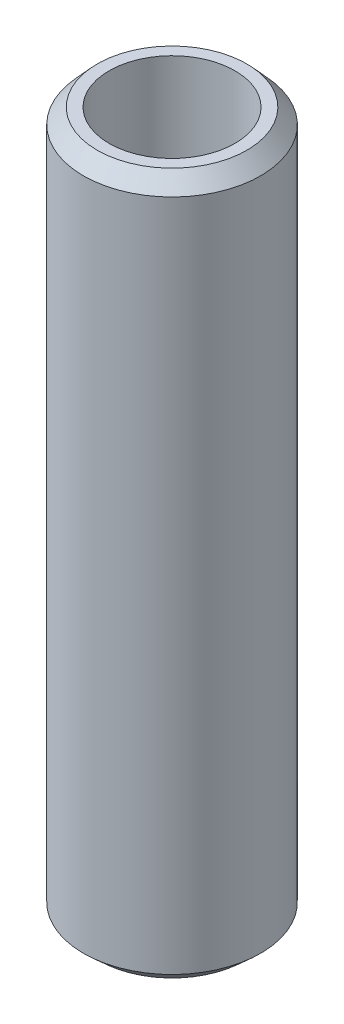
ISO-10303-21;
HEADER;
FILE_DESCRIPTION(('STEP AP214'),'2;1');
FILE_NAME('part.step','',(''),(''),'','','');
FILE_SCHEMA(('AUTOMOTIVE_DESIGN { 1 0 10303 214 1 1 1 1 }'));
ENDSEC;
DATA;
#1=APPLICATION_CONTEXT('core data for automotive mechanical design processes');
#2=APPLICATION_PROTOCOL_DEFINITION('international standard','automotive_design',2000,#1);
#3=PRODUCT_CONTEXT('',#1,'mechanical');
#4=PRODUCT('Part','Part','',(#3));
#5=PRODUCT_RELATED_PRODUCT_CATEGORY('part','',(#4));
#6=PRODUCT_DEFINITION_FORMATION('','',#4);
#7=PRODUCT_DEFINITION_CONTEXT('part definition',#1,'design');
#8=PRODUCT_DEFINITION('design','',#6,#7);
#9=PRODUCT_DEFINITION_SHAPE('','',#8);
#10=(LENGTH_UNIT() NAMED_UNIT(*) SI_UNIT(.MILLI.,.METRE.));
#11=(NAMED_UNIT(*) PLANE_ANGLE_UNIT() SI_UNIT($,.RADIAN.));
#12=(NAMED_UNIT(*) SI_UNIT($,.STERADIAN.) SOLID_ANGLE_UNIT());
#13=UNCERTAINTY_MEASURE_WITH_UNIT(LENGTH_MEASURE(1.E-05),#10,'distance_accuracy_value','');
#14=(GEOMETRIC_REPRESENTATION_CONTEXT(3) GLOBAL_UNCERTAINTY_ASSIGNED_CONTEXT((#13)) GLOBAL_UNIT_ASSIGNED_CONTEXT((#10,
#11,#12)) REPRESENTATION_CONTEXT('',''));
#15=CARTESIAN_POINT('',(0.,0.,0.));
#16=DIRECTION('',(0.,0.,1.));
#17=DIRECTION('',(1.,0.,0.));
#18=AXIS2_PLACEMENT_3D('',#15,#16,#17);
#19=CARTESIAN_POINT('',(0.,198.114677756103,0.));
#20=DIRECTION('',(0.,-1.,0.));
#21=DIRECTION('',(0.,0.,-1.));
#22=AXIS2_PLACEMENT_3D('',#19,#20,#21);
#23=CYLINDRICAL_SURFACE('',#22,25.);
#24=CARTESIAN_POINT('',(0.,193.822095082778,0.));
#25=DIRECTION('',(0.,1.,0.));
#26=DIRECTION('',(0.,0.,1.));
#27=AXIS2_PLACEMENT_3D('',#24,#25,#26);
#28=CIRCLE('',#27,25.);
#29=CARTESIAN_POINT('',(0.,193.822095082778,25.));
#30=VERTEX_POINT('',#29);
#31=EDGE_CURVE('E50',#30,#30,#28,.F.);
#32=ORIENTED_EDGE('',*,*,#31,.T.);
#33=EDGE_LOOP('',(#32));
#34=FACE_BOUND('',#33,.T.);
#35=CARTESIAN_POINT('',(0.,3.89384290129469,0.));
#36=DIRECTION('',(0.,1.,0.));
#37=DIRECTION('',(0.,0.,1.));
#38=AXIS2_PLACEMENT_3D('',#35,#36,#37);
#39=CIRCLE('',#38,25.);
#40=CARTESIAN_POINT('',(0.,3.89384290129469,25.));
#41=VERTEX_POINT('',#40);
#42=EDGE_CURVE('E51',#41,#41,#39,.T.);
#43=ORIENTED_EDGE('',*,*,#42,.T.);
#44=EDGE_LOOP('',(#43));
#45=FACE_BOUND('',#44,.T.);
#46=ADVANCED_FACE('F39',(#34,#45),#23,.T.);
#47=CARTESIAN_POINT('',(0.,198.114677756103,0.));
#48=DIRECTION('',(0.,1.,0.));
#49=DIRECTION('',(0.,0.,1.));
#50=AXIS2_PLACEMENT_3D('',#47,#48,#49);
#51=PLANE('',#50);
#52=CARTESIAN_POINT('',(0.,198.114677756103,0.));
#53=DIRECTION('',(0.,1.,0.));
#54=DIRECTION('',(0.,0.,1.));
#55=AXIS2_PLACEMENT_3D('',#52,#53,#54);
#56=CIRCLE('',#55,21.1061570987053);
#57=CARTESIAN_POINT('',(0.,198.114677756103,21.1061570987053));
#58=VERTEX_POINT('',#57);
#59=EDGE_CURVE('E54',#58,#58,#56,.T.);
#60=ORIENTED_EDGE('',*,*,#59,.T.);
#61=EDGE_LOOP('',(#60));
#62=FACE_BOUND('',#61,.T.);
#63=CARTESIAN_POINT('',(0.,198.114677756103,0.));
#64=DIRECTION('',(0.,1.,0.));
#65=DIRECTION('',(0.,0.,1.));
#66=AXIS2_PLACEMENT_3D('',#63,#64,#65);
#67=CIRCLE('',#66,17.7572472351798);
#68=CARTESIAN_POINT('',(0.,198.114677756103,17.7572472351798));
#69=VERTEX_POINT('',#68);
#70=EDGE_CURVE('E58',#69,#69,#67,.T.);
#71=ORIENTED_EDGE('',*,*,#70,.F.);
#72=EDGE_LOOP('',(#71));
#73=FACE_BOUND('',#72,.T.);
#74=ADVANCED_FACE('F69',(#62,#73),#51,.T.);
#75=CARTESIAN_POINT('',(0.,0.,0.));
#76=DIRECTION('',(0.,1.,0.));
#77=DIRECTION('',(0.,0.,1.));
#78=AXIS2_PLACEMENT_3D('',#75,#76,#77);
#79=PLANE('',#78);
#80=CARTESIAN_POINT('',(0.,0.,0.));
#81=DIRECTION('',(0.,1.,0.));
#82=DIRECTION('',(0.,0.,1.));
#83=AXIS2_PLACEMENT_3D('',#80,#81,#82);
#84=CIRCLE('',#83,20.7074173266759);
#85=CARTESIAN_POINT('',(0.,0.,20.7074173266759));
#86=VERTEX_POINT('',#85);
#87=EDGE_CURVE('E10',#86,#86,#84,.F.);
#88=ORIENTED_EDGE('',*,*,#87,.T.);
#89=EDGE_LOOP('',(#88));
#90=FACE_BOUND('',#89,.T.);
#91=CARTESIAN_POINT('',(0.,0.,0.));
#92=DIRECTION('',(0.,1.,0.));
#93=DIRECTION('',(0.,0.,1.));
#94=AXIS2_PLACEMENT_3D('',#91,#92,#93);
#95=CIRCLE('',#94,17.7572472351798);
#96=CARTESIAN_POINT('',(0.,0.,17.7572472351798));
#97=VERTEX_POINT('',#96);
#98=EDGE_CURVE('E63',#97,#97,#95,.T.);
#99=ORIENTED_EDGE('',*,*,#98,.T.);
#100=EDGE_LOOP('',(#99));
#101=FACE_BOUND('',#100,.T.);
#102=ADVANCED_FACE('F75',(#90,#101),#79,.F.);
#103=CARTESIAN_POINT('',(0.,198.114677756103,0.));
#104=DIRECTION('',(0.,-1.,0.));
#105=DIRECTION('',(0.,0.,-1.));
#106=AXIS2_PLACEMENT_3D('',#103,#104,#105);
#107=CYLINDRICAL_SURFACE('',#106,17.7572472351798);
#108=ORIENTED_EDGE('',*,*,#70,.T.);
#109=EDGE_LOOP('',(#108));
#110=FACE_BOUND('',#109,.T.);
#111=ORIENTED_EDGE('',*,*,#98,.F.);
#112=EDGE_LOOP('',(#111));
#113=FACE_BOUND('',#112,.T.);
#114=ADVANCED_FACE('F70',(#110,#113),#107,.F.);
#115=CARTESIAN_POINT('',(0.,198.114677756103,0.));
#116=DIRECTION('',(0.,-1.,0.));
#117=DIRECTION('',(0.,0.,-1.));
#118=AXIS2_PLACEMENT_3D('',#115,#116,#117);
#119=CONICAL_SURFACE('',#118,21.1061570987053,0.736729194112089);
#120=ORIENTED_EDGE('',*,*,#31,.F.);
#121=EDGE_LOOP('',(#120));
#122=FACE_BOUND('',#121,.T.);
#123=ORIENTED_EDGE('',*,*,#59,.F.);
#124=EDGE_LOOP('',(#123));
#125=FACE_BOUND('',#124,.T.);
#126=ADVANCED_FACE('F81',(#122,#125),#119,.T.);
#127=CARTESIAN_POINT('',(0.,3.89384290129469,0.));
#128=DIRECTION('',(0.,1.,0.));
#129=DIRECTION('',(0.,0.,1.));
#130=AXIS2_PLACEMENT_3D('',#127,#128,#129);
#131=CONICAL_SURFACE('',#130,25.,0.834067132682809);
#132=CARTESIAN_POINT('',(0.,0.,20.7074173266759));
#133=CARTESIAN_POINT('',(0.,0.0405608635551529,20.752131729523));
#134=CARTESIAN_POINT('',(0.,0.0811217271103057,20.7968461323702));
#135=CARTESIAN_POINT('',(0.,0.162243454220611,20.8862749380644));
#136=CARTESIAN_POINT('',(0.,0.202804317775764,20.9309893409115));
#137=CARTESIAN_POINT('',(0.,0.28392604488607,21.0204181466058));
#138=CARTESIAN_POINT('',(0.,0.324486908441224,21.0651325494529));
#139=CARTESIAN_POINT('',(0.,0.40560863555153,21.1545613551472));
#140=CARTESIAN_POINT('',(0.,0.446169499106682,21.1992757579943));
#141=CARTESIAN_POINT('',(0.,0.527291226216988,21.2887045636886));
#142=CARTESIAN_POINT('',(0.,0.567852089772141,21.3334189665357));
#143=CARTESIAN_POINT('',(0.,0.648973816882447,21.4228477722299));
#144=CARTESIAN_POINT('',(0.,0.6895346804376,21.4675621750771));
#145=CARTESIAN_POINT('',(0.,0.770656407547906,21.5569909807713));
#146=CARTESIAN_POINT('',(0.,0.811217271103059,21.6017053836184));
#147=CARTESIAN_POINT('',(0.,0.892338998213365,21.6911341893127));
#148=CARTESIAN_POINT('',(0.,0.932899861768518,21.7358485921598));
#149=CARTESIAN_POINT('',(0.,1.01402158887882,21.8252773978541));
#150=CARTESIAN_POINT('',(0.,1.05458245243398,21.8699918007012));
#151=CARTESIAN_POINT('',(0.,1.13570417954428,21.9594206063954));
#152=CARTESIAN_POINT('',(0.,1.17626504309944,22.0041350092426));
#153=CARTESIAN_POINT('',(0.,1.25738677020974,22.0935638149368));
#154=CARTESIAN_POINT('',(0.,1.29794763376489,22.1382782177839));
#155=CARTESIAN_POINT('',(0.,1.3790693608752,22.2277070234782));
#156=CARTESIAN_POINT('',(0.,1.41963022443035,22.2724214263253));
#157=CARTESIAN_POINT('',(0.,1.50075195154066,22.3618502320196));
#158=CARTESIAN_POINT('',(0.,1.54131281509581,22.4065646348667));
#159=CARTESIAN_POINT('',(0.,1.62243454220612,22.4959934405609));
#160=CARTESIAN_POINT('',(0.,1.66299540576127,22.5407078434081));
#161=CARTESIAN_POINT('',(0.,1.74411713287158,22.6301366491023));
#162=CARTESIAN_POINT('',(0.,1.78467799642673,22.6748510519495));
#163=CARTESIAN_POINT('',(0.,1.86579972353704,22.7642798576437));
#164=CARTESIAN_POINT('',(0.,1.90636058709219,22.8089942604908));
#165=CARTESIAN_POINT('',(0.,1.9874823142025,22.8984230661851));
#166=CARTESIAN_POINT('',(0.,2.02804317775765,22.9431374690322));
#167=CARTESIAN_POINT('',(0.,2.10916490486796,23.0325662747265));
#168=CARTESIAN_POINT('',(0.,2.14972576842311,23.0772806775736));
#169=CARTESIAN_POINT('',(0.,2.23084749553341,23.1667094832678));
#170=CARTESIAN_POINT('',(0.,2.27140835908857,23.211423886115));
#171=CARTESIAN_POINT('',(0.,2.35253008619887,23.3008526918092));
#172=CARTESIAN_POINT('',(0.,2.39309094975403,23.3455670946563));
#173=CARTESIAN_POINT('',(0.,2.47421267686433,23.4349959003506));
#174=CARTESIAN_POINT('',(0.,2.51477354041949,23.4797103031977));
#175=CARTESIAN_POINT('',(0.,2.59589526752979,23.569139108892));
#176=CARTESIAN_POINT('',(0.,2.63645613108494,23.6138535117391));
#177=CARTESIAN_POINT('',(0.,2.71757785819525,23.7032823174333));
#178=CARTESIAN_POINT('',(0.,2.7581387217504,23.7479967202805));
#179=CARTESIAN_POINT('',(0.,2.83926044886071,23.8374255259747));
#180=CARTESIAN_POINT('',(0.,2.87982131241586,23.8821399288219));
#181=CARTESIAN_POINT('',(0.,2.96094303952617,23.9715687345161));
#182=CARTESIAN_POINT('',(0.,3.00150390308132,24.0162831373632));
#183=CARTESIAN_POINT('',(0.,3.08262563019163,24.1057119430575));
#184=CARTESIAN_POINT('',(0.,3.12318649374678,24.1504263459046));
#185=CARTESIAN_POINT('',(0.,3.20430822085709,24.2398551515989));
#186=CARTESIAN_POINT('',(0.,3.24486908441224,24.284569554446));
#187=CARTESIAN_POINT('',(0.,3.32599081152254,24.3739983601402));
#188=CARTESIAN_POINT('',(0.,3.3665516750777,24.4187127629874));
#189=CARTESIAN_POINT('',(0.,3.447673402188,24.5081415686816));
#190=CARTESIAN_POINT('',(0.,3.48823426574316,24.5528559715287));
#191=CARTESIAN_POINT('',(0.,3.56935599285346,24.642284777223));
#192=CARTESIAN_POINT('',(0.,3.60991685640861,24.6869991800701));
#193=CARTESIAN_POINT('',(0.,3.69103858351892,24.7764279857644));
#194=CARTESIAN_POINT('',(0.,3.73159944707407,24.8211423886115));
#195=CARTESIAN_POINT('',(0.,3.81272117418438,24.9105711943057));
#196=CARTESIAN_POINT('',(0.,3.85328203773953,24.9552855971529));
#197=CARTESIAN_POINT('',(0.,3.89384290129469,25.));
#198=B_SPLINE_CURVE_WITH_KNOTS('',3,(#132,#133,#134,#135,#136,#137,#138,#139,#140,#141,#142,
#143,#144,#145,#146,#147,#148,#149,#150,#151,#152,#153,#154,#155,#156,#157,#158,#159,#160,#161,
#162,#163,#164,#165,#166,#167,#168,#169,#170,#171,#172,#173,#174,#175,#176,#177,#178,#179,#180,
#181,#182,#183,#184,#185,#186,#187,#188,#189,#190,#191,#192,#193,#194,#195,#196,#197),
.UNSPECIFIED.,.F.,.F.,(4,2,2,2,2,2,2,2,2,2,2,2,2,2,2,2,2,2,2,2,2,2,2,2,2,2,2,2,2,2,2,2,4),(0.,
0.18111061059152,0.362221221183041,0.543331831774559,0.724442442366079,0.9055530529576,
1.08666366354912,1.26777427414064,1.44888488473216,1.62999549532368,1.8111061059152,
1.99221671650672,2.17332732709824,2.35443793768976,2.53554854828128,2.7166591588728,
2.89776976946432,3.07888038005584,3.25999099064736,3.44110160123888,3.6222122118304,
3.80332282242192,3.98443343301344,4.16554404360496,4.34665465419648,4.527765264788,
4.70887587537952,4.88998648597104,5.07109709656256,5.25220770715408,5.4333183177456,
5.61442892833712,5.79553953892864),.UNSPECIFIED.);
#199=EDGE_CURVE('BSEAM45',#86,#41,#198,.T.);
#200=ORIENTED_EDGE('',*,*,#87,.F.);
#201=ORIENTED_EDGE('',*,*,#42,.F.);
#202=ORIENTED_EDGE('',*,*,#199,.T.);
#203=ORIENTED_EDGE('',*,*,#199,.F.);
#204=EDGE_LOOP('',(#200,#202,#201,#203));
#205=FACE_BOUND('',#204,.T.);
#206=ADVANCED_FACE('F45',(#205),#131,.T.);
#207=CLOSED_SHELL('',(#46,#74,#102,#114,#126,#206));
#208=MANIFOLD_SOLID_BREP('B2',#207);
#209=ADVANCED_BREP_SHAPE_REPRESENTATION('',(#18,#208),#14);
#210=SHAPE_DEFINITION_REPRESENTATION(#9,#209);
ENDSEC;
END-ISO-10303-21;
